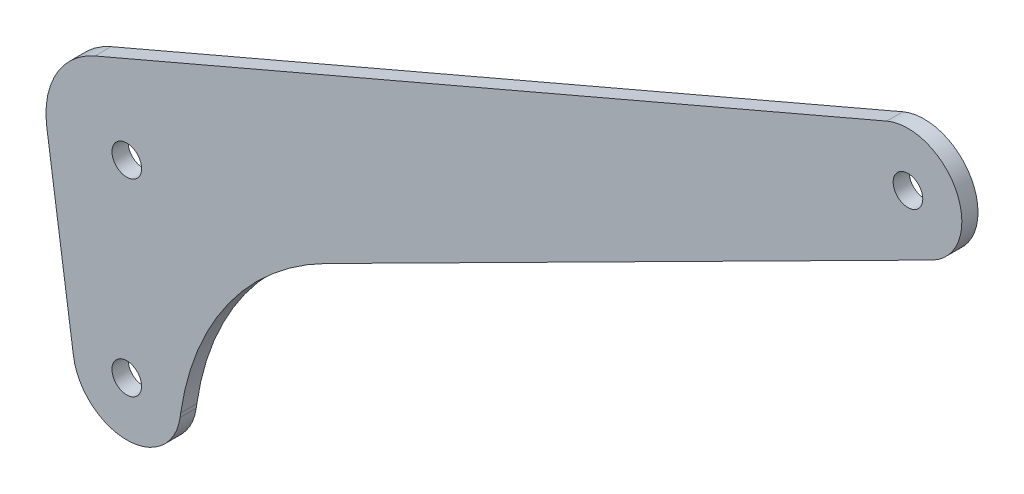
ISO-10303-21;
HEADER;
FILE_DESCRIPTION(('STEP AP214'),'2;1');
FILE_NAME('part.step','',(''),(''),'','','');
FILE_SCHEMA(('AUTOMOTIVE_DESIGN { 1 0 10303 214 1 1 1 1 }'));
ENDSEC;
DATA;
#1=APPLICATION_CONTEXT('core data for automotive mechanical design processes');
#2=APPLICATION_PROTOCOL_DEFINITION('international standard','automotive_design',2000,#1);
#3=PRODUCT_CONTEXT('',#1,'mechanical');
#4=PRODUCT('Part','Part','',(#3));
#5=PRODUCT_RELATED_PRODUCT_CATEGORY('part','',(#4));
#6=PRODUCT_DEFINITION_FORMATION('','',#4);
#7=PRODUCT_DEFINITION_CONTEXT('part definition',#1,'design');
#8=PRODUCT_DEFINITION('design','',#6,#7);
#9=PRODUCT_DEFINITION_SHAPE('','',#8);
#10=(LENGTH_UNIT() NAMED_UNIT(*) SI_UNIT(.MILLI.,.METRE.));
#11=(NAMED_UNIT(*) PLANE_ANGLE_UNIT() SI_UNIT($,.RADIAN.));
#12=(NAMED_UNIT(*) SI_UNIT($,.STERADIAN.) SOLID_ANGLE_UNIT());
#13=UNCERTAINTY_MEASURE_WITH_UNIT(LENGTH_MEASURE(1.E-05),#10,'distance_accuracy_value','');
#14=(GEOMETRIC_REPRESENTATION_CONTEXT(3) GLOBAL_UNCERTAINTY_ASSIGNED_CONTEXT((#13)) GLOBAL_UNIT_ASSIGNED_CONTEXT((#10,
#11,#12)) REPRESENTATION_CONTEXT('',''));
#15=CARTESIAN_POINT('',(0.,0.,0.));
#16=DIRECTION('',(0.,0.,1.));
#17=DIRECTION('',(1.,0.,0.));
#18=AXIS2_PLACEMENT_3D('',#15,#16,#17);
#19=CARTESIAN_POINT('',(0.,35.,3.));
#20=DIRECTION('',(0.,0.,-1.));
#21=DIRECTION('',(-1.,0.,0.));
#22=AXIS2_PLACEMENT_3D('',#19,#20,#21);
#23=CYLINDRICAL_SURFACE('',#22,15.);
#24=CARTESIAN_POINT('',(0.,35.,0.));
#25=DIRECTION('',(0.,0.,1.));
#26=DIRECTION('',(1.,0.,0.));
#27=AXIS2_PLACEMENT_3D('',#24,#25,#26);
#28=CIRCLE('',#27,15.);
#29=CARTESIAN_POINT('',(-5.91134604627073,48.7860794978572,0.));
#30=VERTEX_POINT('',#29);
#31=CARTESIAN_POINT('',(-14.8461497791618,32.8571428571429,0.));
#32=VERTEX_POINT('',#31);
#33=EDGE_CURVE('E133',#30,#32,#28,.T.);
#34=ORIENTED_EDGE('',*,*,#33,.T.);
#35=DIRECTION('',(0.,0.,-1.));
#36=VECTOR('',#35,1.);
#37=CARTESIAN_POINT('',(-14.8461497791618,32.8571428571429,3.));
#38=LINE('',#37,#36);
#39=CARTESIAN_POINT('',(-14.8461497791618,32.8571428571429,3.));
#40=VERTEX_POINT('',#39);
#41=EDGE_CURVE('E11',#40,#32,#38,.T.);
#42=ORIENTED_EDGE('',*,*,#41,.F.);
#43=CARTESIAN_POINT('',(0.,35.,3.));
#44=DIRECTION('',(0.,0.,1.));
#45=DIRECTION('',(1.,0.,0.));
#46=AXIS2_PLACEMENT_3D('',#43,#44,#45);
#47=CIRCLE('',#46,15.);
#48=CARTESIAN_POINT('',(-5.91134604627073,48.7860794978572,3.));
#49=VERTEX_POINT('',#48);
#50=EDGE_CURVE('E91',#49,#40,#47,.T.);
#51=ORIENTED_EDGE('',*,*,#50,.F.);
#52=DIRECTION('',(0.,0.,-1.));
#53=VECTOR('',#52,1.);
#54=CARTESIAN_POINT('',(-5.91134604627073,48.7860794978572,3.));
#55=LINE('',#54,#53);
#56=EDGE_CURVE('E132',#49,#30,#55,.T.);
#57=ORIENTED_EDGE('',*,*,#56,.T.);
#58=EDGE_LOOP('',(#34,#42,#51,#57));
#59=FACE_BOUND('',#58,.T.);
#60=ADVANCED_FACE('F36',(#59),#23,.T.);
#61=CARTESIAN_POINT('',(-9.89743318610787,-1.42857142857143,3.));
#62=DIRECTION('',(-0.989743318610787,-0.142857142857143,0.));
#63=DIRECTION('',(0.142857142857143,-0.989743318610787,0.));
#64=AXIS2_PLACEMENT_3D('',#61,#62,#63);
#65=PLANE('',#64);
#66=DIRECTION('',(-0.142857142857143,0.989743318610787,0.));
#67=VECTOR('',#66,1.);
#68=CARTESIAN_POINT('',(-9.89743318610787,-1.42857142857143,0.));
#69=LINE('',#68,#67);
#70=CARTESIAN_POINT('',(-9.89743318610787,-1.42857142857143,0.));
#71=VERTEX_POINT('',#70);
#72=EDGE_CURVE('E136',#71,#32,#69,.T.);
#73=ORIENTED_EDGE('',*,*,#72,.F.);
#74=DIRECTION('',(0.,0.,-1.));
#75=VECTOR('',#74,1.);
#76=CARTESIAN_POINT('',(-9.89743318610787,-1.42857142857143,3.));
#77=LINE('',#76,#75);
#78=CARTESIAN_POINT('',(-9.89743318610787,-1.42857142857143,3.));
#79=VERTEX_POINT('',#78);
#80=EDGE_CURVE('E44',#79,#71,#77,.T.);
#81=ORIENTED_EDGE('',*,*,#80,.F.);
#82=DIRECTION('',(-0.142857142857143,0.989743318610787,0.));
#83=VECTOR('',#82,1.);
#84=CARTESIAN_POINT('',(-9.89743318610787,-1.42857142857143,3.));
#85=LINE('',#84,#83);
#86=EDGE_CURVE('E173',#79,#40,#85,.T.);
#87=ORIENTED_EDGE('',*,*,#86,.T.);
#88=ORIENTED_EDGE('',*,*,#41,.T.);
#89=EDGE_LOOP('',(#73,#81,#87,#88));
#90=FACE_BOUND('',#89,.T.);
#91=ADVANCED_FACE('F172',(#90),#65,.T.);
#92=CARTESIAN_POINT('',(0.,0.,3.));
#93=DIRECTION('',(0.,0.,-1.));
#94=DIRECTION('',(-1.,0.,0.));
#95=AXIS2_PLACEMENT_3D('',#92,#93,#94);
#96=CYLINDRICAL_SURFACE('',#95,10.);
#97=CARTESIAN_POINT('',(0.,0.,0.));
#98=DIRECTION('',(0.,0.,1.));
#99=DIRECTION('',(1.,0.,0.));
#100=AXIS2_PLACEMENT_3D('',#97,#98,#99);
#101=CIRCLE('',#100,10.);
#102=CARTESIAN_POINT('',(9.89743318610787,-1.42857142857143,0.));
#103=VERTEX_POINT('',#102);
#104=EDGE_CURVE('E140',#71,#103,#101,.T.);
#105=ORIENTED_EDGE('',*,*,#104,.T.);
#106=DIRECTION('',(0.,0.,-1.));
#107=VECTOR('',#106,1.);
#108=CARTESIAN_POINT('',(9.89743318610787,-1.42857142857143,3.));
#109=LINE('',#108,#107);
#110=CARTESIAN_POINT('',(9.89743318610787,-1.42857142857143,3.));
#111=VERTEX_POINT('',#110);
#112=EDGE_CURVE('E157',#111,#103,#109,.T.);
#113=ORIENTED_EDGE('',*,*,#112,.F.);
#114=CARTESIAN_POINT('',(0.,0.,3.));
#115=DIRECTION('',(0.,0.,1.));
#116=DIRECTION('',(1.,0.,0.));
#117=AXIS2_PLACEMENT_3D('',#114,#115,#116);
#118=CIRCLE('',#117,10.);
#119=EDGE_CURVE('E163',#79,#111,#118,.T.);
#120=ORIENTED_EDGE('',*,*,#119,.F.);
#121=ORIENTED_EDGE('',*,*,#80,.T.);
#122=EDGE_LOOP('',(#105,#113,#120,#121));
#123=FACE_BOUND('',#122,.T.);
#124=ADVANCED_FACE('F161',(#123),#96,.T.);
#125=CARTESIAN_POINT('',(9.89743318610787,-1.42857142857143,3.));
#126=DIRECTION('',(0.989743318610787,-0.142857142857143,0.));
#127=DIRECTION('',(0.142857142857143,0.989743318610787,0.));
#128=AXIS2_PLACEMENT_3D('',#125,#126,#127);
#129=PLANE('',#128);
#130=DIRECTION('',(-0.142857142857143,-0.989743318610787,0.));
#131=VECTOR('',#130,1.);
#132=CARTESIAN_POINT('',(9.89743318610787,-1.42857142857143,0.));
#133=LINE('',#132,#131);
#134=CARTESIAN_POINT('',(10.012724365218,-0.629810709038242,0.));
#135=VERTEX_POINT('',#134);
#136=EDGE_CURVE('E143',#135,#103,#133,.T.);
#137=ORIENTED_EDGE('',*,*,#136,.F.);
#138=DIRECTION('',(0.,0.,-1.));
#139=VECTOR('',#138,1.);
#140=CARTESIAN_POINT('',(10.012724365218,-0.629810709038242,3.));
#141=LINE('',#140,#139);
#142=CARTESIAN_POINT('',(10.012724365218,-0.629810709038242,3.));
#143=VERTEX_POINT('',#142);
#144=EDGE_CURVE('E155',#143,#135,#141,.T.);
#145=ORIENTED_EDGE('',*,*,#144,.F.);
#146=DIRECTION('',(-0.142857142857143,-0.989743318610787,0.));
#147=VECTOR('',#146,1.);
#148=CARTESIAN_POINT('',(9.89743318610787,-1.42857142857143,3.));
#149=LINE('',#148,#147);
#150=EDGE_CURVE('E127',#143,#111,#149,.T.);
#151=ORIENTED_EDGE('',*,*,#150,.T.);
#152=ORIENTED_EDGE('',*,*,#112,.T.);
#153=EDGE_LOOP('',(#137,#145,#151,#152));
#154=FACE_BOUND('',#153,.T.);
#155=ADVANCED_FACE('F177',(#154),#129,.T.);
#156=CARTESIAN_POINT('',(59.4998902957574,-7.77266785189538,3.));
#157=DIRECTION('',(0.,0.,-1.));
#158=DIRECTION('',(-1.,0.,0.));
#159=AXIS2_PLACEMENT_3D('',#156,#157,#158);
#160=CYLINDRICAL_SURFACE('',#159,50.);
#161=CARTESIAN_POINT('',(59.4998902957574,-7.77266785189538,0.));
#162=DIRECTION('',(0.,0.,1.));
#163=DIRECTION('',(1.,0.,0.));
#164=AXIS2_PLACEMENT_3D('',#161,#162,#163);
#165=CIRCLE('',#164,50.);
#166=CARTESIAN_POINT('',(36.9631916403654,36.8602484063557,0.));
#167=VERTEX_POINT('',#166);
#168=EDGE_CURVE('E146',#135,#167,#165,.F.);
#169=ORIENTED_EDGE('',*,*,#168,.T.);
#170=DIRECTION('',(0.,0.,-1.));
#171=VECTOR('',#170,1.);
#172=CARTESIAN_POINT('',(36.9631916403654,36.8602484063557,3.));
#173=LINE('',#172,#171);
#174=CARTESIAN_POINT('',(36.9631916403654,36.8602484063557,3.));
#175=VERTEX_POINT('',#174);
#176=EDGE_CURVE('E115',#175,#167,#173,.T.);
#177=ORIENTED_EDGE('',*,*,#176,.F.);
#178=CARTESIAN_POINT('',(59.4998902957574,-7.77266785189538,3.));
#179=DIRECTION('',(0.,0.,1.));
#180=DIRECTION('',(1.,0.,0.));
#181=AXIS2_PLACEMENT_3D('',#178,#179,#180);
#182=CIRCLE('',#181,50.);
#183=EDGE_CURVE('E124',#143,#175,#182,.F.);
#184=ORIENTED_EDGE('',*,*,#183,.F.);
#185=ORIENTED_EDGE('',*,*,#144,.T.);
#186=EDGE_LOOP('',(#169,#177,#184,#185));
#187=FACE_BOUND('',#186,.T.);
#188=ADVANCED_FACE('F236',(#187),#160,.F.);
#189=CARTESIAN_POINT('',(-7.32129057691211,14.4994861145494,3.));
#190=DIRECTION('',(0.45073397310784,-0.892658325165021,0.));
#191=DIRECTION('',(0.892658325165022,0.45073397310784,0.));
#192=AXIS2_PLACEMENT_3D('',#189,#190,#191);
#193=PLANE('',#192);
#194=DIRECTION('',(-0.892658325165022,-0.45073397310784,0.));
#195=VECTOR('',#194,1.);
#196=CARTESIAN_POINT('',(-7.32129057691211,14.4994861145494,0.));
#197=LINE('',#196,#195);
#198=CARTESIAN_POINT('',(149.516585656943,93.6923386268613,0.));
#199=VERTEX_POINT('',#198);
#200=EDGE_CURVE('E114',#199,#167,#197,.T.);
#201=ORIENTED_EDGE('',*,*,#200,.F.);
#202=DIRECTION('',(0.,0.,-1.));
#203=VECTOR('',#202,1.);
#204=CARTESIAN_POINT('',(149.516585656943,93.6923386268613,3.));
#205=LINE('',#204,#203);
#206=CARTESIAN_POINT('',(149.516585656943,93.6923386268613,3.));
#207=VERTEX_POINT('',#206);
#208=EDGE_CURVE('E108',#207,#199,#205,.T.);
#209=ORIENTED_EDGE('',*,*,#208,.F.);
#210=DIRECTION('',(-0.892658325165022,-0.45073397310784,0.));
#211=VECTOR('',#210,1.);
#212=CARTESIAN_POINT('',(-7.32129057691211,14.4994861145494,3.));
#213=LINE('',#212,#211);
#214=EDGE_CURVE('E112',#207,#175,#213,.T.);
#215=ORIENTED_EDGE('',*,*,#214,.T.);
#216=ORIENTED_EDGE('',*,*,#176,.T.);
#217=EDGE_LOOP('',(#201,#209,#215,#216));
#218=FACE_BOUND('',#217,.T.);
#219=ADVANCED_FACE('F110',(#218),#193,.T.);
#220=CARTESIAN_POINT('',(145.009245925864,102.618921878512,3.));
#221=DIRECTION('',(0.,0.,-1.));
#222=DIRECTION('',(-1.,0.,0.));
#223=AXIS2_PLACEMENT_3D('',#220,#221,#222);
#224=CYLINDRICAL_SURFACE('',#223,10.);
#225=CARTESIAN_POINT('',(145.009245925864,102.618921878512,0.));
#226=DIRECTION('',(0.,0.,1.));
#227=DIRECTION('',(1.,0.,0.));
#228=AXIS2_PLACEMENT_3D('',#225,#226,#227);
#229=CIRCLE('',#228,10.);
#230=CARTESIAN_POINT('',(141.068348561684,111.80964154375,0.));
#231=VERTEX_POINT('',#230);
#232=EDGE_CURVE('E79',#199,#231,#229,.T.);
#233=ORIENTED_EDGE('',*,*,#232,.T.);
#234=DIRECTION('',(0.,0.,-1.));
#235=VECTOR('',#234,1.);
#236=CARTESIAN_POINT('',(141.068348561684,111.80964154375,3.));
#237=LINE('',#236,#235);
#238=CARTESIAN_POINT('',(141.068348561684,111.80964154375,3.));
#239=VERTEX_POINT('',#238);
#240=EDGE_CURVE('E116',#239,#231,#237,.T.);
#241=ORIENTED_EDGE('',*,*,#240,.F.);
#242=CARTESIAN_POINT('',(145.009245925864,102.618921878512,3.));
#243=DIRECTION('',(0.,0.,1.));
#244=DIRECTION('',(1.,0.,0.));
#245=AXIS2_PLACEMENT_3D('',#242,#243,#244);
#246=CIRCLE('',#245,10.);
#247=EDGE_CURVE('E118',#207,#239,#246,.T.);
#248=ORIENTED_EDGE('',*,*,#247,.F.);
#249=ORIENTED_EDGE('',*,*,#208,.T.);
#250=EDGE_LOOP('',(#233,#241,#248,#249));
#251=FACE_BOUND('',#250,.T.);
#252=ADVANCED_FACE('F119',(#251),#224,.T.);
#253=CARTESIAN_POINT('',(-18.5882350625513,43.3503442856056,3.));
#254=DIRECTION('',(0.394089736418049,-0.919071966523815,0.));
#255=DIRECTION('',(0.919071966523815,0.394089736418049,0.));
#256=AXIS2_PLACEMENT_3D('',#253,#254,#255);
#257=PLANE('',#256);
#258=DIRECTION('',(-0.919071966523815,-0.394089736418049,0.));
#259=VECTOR('',#258,1.);
#260=CARTESIAN_POINT('',(-18.5882350625513,43.3503442856056,0.));
#261=LINE('',#260,#259);
#262=EDGE_CURVE('E85',#231,#30,#261,.T.);
#263=ORIENTED_EDGE('',*,*,#262,.T.);
#264=ORIENTED_EDGE('',*,*,#56,.F.);
#265=DIRECTION('',(-0.919071966523815,-0.394089736418049,0.));
#266=VECTOR('',#265,1.);
#267=CARTESIAN_POINT('',(-18.5882350625513,43.3503442856056,3.));
#268=LINE('',#267,#266);
#269=EDGE_CURVE('E52',#239,#49,#268,.T.);
#270=ORIENTED_EDGE('',*,*,#269,.F.);
#271=ORIENTED_EDGE('',*,*,#240,.T.);
#272=EDGE_LOOP('',(#263,#264,#270,#271));
#273=FACE_BOUND('',#272,.T.);
#274=ADVANCED_FACE('F205',(#273),#257,.F.);
#275=CARTESIAN_POINT('',(0.,0.,3.));
#276=DIRECTION('',(0.,0.,1.));
#277=DIRECTION('',(1.,0.,0.));
#278=AXIS2_PLACEMENT_3D('',#275,#276,#277);
#279=PLANE('',#278);
#280=CARTESIAN_POINT('',(145.009245925864,102.618921878512,3.));
#281=DIRECTION('',(0.,0.,1.));
#282=DIRECTION('',(1.,0.,0.));
#283=AXIS2_PLACEMENT_3D('',#280,#281,#282);
#284=CIRCLE('',#283,2.74999999999997);
#285=CARTESIAN_POINT('',(147.759245925864,102.618921878512,3.));
#286=VERTEX_POINT('',#285);
#287=EDGE_CURVE('E197',#286,#286,#284,.T.);
#288=ORIENTED_EDGE('',*,*,#287,.F.);
#289=EDGE_LOOP('',(#288));
#290=FACE_BOUND('',#289,.T.);
#291=CARTESIAN_POINT('',(0.,35.,3.));
#292=DIRECTION('',(0.,0.,1.));
#293=DIRECTION('',(1.,0.,0.));
#294=AXIS2_PLACEMENT_3D('',#291,#292,#293);
#295=CIRCLE('',#294,2.74999999999999);
#296=CARTESIAN_POINT('',(2.74999999999999,35.,3.));
#297=VERTEX_POINT('',#296);
#298=EDGE_CURVE('E191',#297,#297,#295,.T.);
#299=ORIENTED_EDGE('',*,*,#298,.F.);
#300=EDGE_LOOP('',(#299));
#301=FACE_BOUND('',#300,.T.);
#302=CARTESIAN_POINT('',(0.,0.,3.));
#303=DIRECTION('',(0.,0.,1.));
#304=DIRECTION('',(1.,0.,0.));
#305=AXIS2_PLACEMENT_3D('',#302,#303,#304);
#306=CIRCLE('',#305,2.74999999999999);
#307=CARTESIAN_POINT('',(2.74999999999999,0.,3.));
#308=VERTEX_POINT('',#307);
#309=EDGE_CURVE('E185',#308,#308,#306,.T.);
#310=ORIENTED_EDGE('',*,*,#309,.F.);
#311=EDGE_LOOP('',(#310));
#312=FACE_BOUND('',#311,.T.);
#313=ORIENTED_EDGE('',*,*,#50,.T.);
#314=ORIENTED_EDGE('',*,*,#86,.F.);
#315=ORIENTED_EDGE('',*,*,#119,.T.);
#316=ORIENTED_EDGE('',*,*,#150,.F.);
#317=ORIENTED_EDGE('',*,*,#183,.T.);
#318=ORIENTED_EDGE('',*,*,#214,.F.);
#319=ORIENTED_EDGE('',*,*,#247,.T.);
#320=ORIENTED_EDGE('',*,*,#269,.T.);
#321=EDGE_LOOP('',(#313,#314,#315,#316,#317,#318,#319,#320));
#322=FACE_BOUND('',#321,.T.);
#323=ADVANCED_FACE('F121',(#290,#301,#312,#322),#279,.T.);
#324=CARTESIAN_POINT('',(0.,0.,0.));
#325=DIRECTION('',(0.,0.,1.));
#326=DIRECTION('',(1.,0.,0.));
#327=AXIS2_PLACEMENT_3D('',#324,#325,#326);
#328=PLANE('',#327);
#329=CARTESIAN_POINT('',(145.009245925864,102.618921878512,0.));
#330=DIRECTION('',(0.,0.,1.));
#331=DIRECTION('',(1.,0.,0.));
#332=AXIS2_PLACEMENT_3D('',#329,#330,#331);
#333=CIRCLE('',#332,2.75);
#334=CARTESIAN_POINT('',(147.759245925864,102.618921878512,0.));
#335=VERTEX_POINT('',#334);
#336=EDGE_CURVE('E194',#335,#335,#333,.T.);
#337=ORIENTED_EDGE('',*,*,#336,.T.);
#338=EDGE_LOOP('',(#337));
#339=FACE_BOUND('',#338,.T.);
#340=CARTESIAN_POINT('',(0.,35.,0.));
#341=DIRECTION('',(0.,0.,1.));
#342=DIRECTION('',(1.,0.,0.));
#343=AXIS2_PLACEMENT_3D('',#340,#341,#342);
#344=CIRCLE('',#343,2.75);
#345=CARTESIAN_POINT('',(2.75,35.,0.));
#346=VERTEX_POINT('',#345);
#347=EDGE_CURVE('E188',#346,#346,#344,.T.);
#348=ORIENTED_EDGE('',*,*,#347,.T.);
#349=EDGE_LOOP('',(#348));
#350=FACE_BOUND('',#349,.T.);
#351=CARTESIAN_POINT('',(0.,0.,0.));
#352=DIRECTION('',(0.,0.,1.));
#353=DIRECTION('',(1.,0.,0.));
#354=AXIS2_PLACEMENT_3D('',#351,#352,#353);
#355=CIRCLE('',#354,2.75);
#356=CARTESIAN_POINT('',(2.75,0.,0.));
#357=VERTEX_POINT('',#356);
#358=EDGE_CURVE('E137',#357,#357,#355,.T.);
#359=ORIENTED_EDGE('',*,*,#358,.T.);
#360=EDGE_LOOP('',(#359));
#361=FACE_BOUND('',#360,.T.);
#362=ORIENTED_EDGE('',*,*,#33,.F.);
#363=ORIENTED_EDGE('',*,*,#262,.F.);
#364=ORIENTED_EDGE('',*,*,#232,.F.);
#365=ORIENTED_EDGE('',*,*,#200,.T.);
#366=ORIENTED_EDGE('',*,*,#168,.F.);
#367=ORIENTED_EDGE('',*,*,#136,.T.);
#368=ORIENTED_EDGE('',*,*,#104,.F.);
#369=ORIENTED_EDGE('',*,*,#72,.T.);
#370=EDGE_LOOP('',(#362,#363,#364,#365,#366,#367,#368,#369));
#371=FACE_BOUND('',#370,.T.);
#372=ADVANCED_FACE('F169',(#339,#350,#361,#371),#328,.F.);
#373=CARTESIAN_POINT('',(0.,0.,3.));
#374=DIRECTION('',(0.,0.,1.));
#375=DIRECTION('',(1.,0.,0.));
#376=AXIS2_PLACEMENT_3D('',#373,#374,#375);
#377=CYLINDRICAL_SURFACE('',#376,2.74999999999999);
#378=ORIENTED_EDGE('',*,*,#358,.F.);
#379=EDGE_LOOP('',(#378));
#380=FACE_BOUND('',#379,.T.);
#381=ORIENTED_EDGE('',*,*,#309,.T.);
#382=EDGE_LOOP('',(#381));
#383=FACE_BOUND('',#382,.T.);
#384=ADVANCED_FACE('F211',(#380,#383),#377,.F.);
#385=CARTESIAN_POINT('',(0.,35.,3.));
#386=DIRECTION('',(0.,0.,1.));
#387=DIRECTION('',(1.,0.,0.));
#388=AXIS2_PLACEMENT_3D('',#385,#386,#387);
#389=CYLINDRICAL_SURFACE('',#388,2.74999999999999);
#390=ORIENTED_EDGE('',*,*,#347,.F.);
#391=EDGE_LOOP('',(#390));
#392=FACE_BOUND('',#391,.T.);
#393=ORIENTED_EDGE('',*,*,#298,.T.);
#394=EDGE_LOOP('',(#393));
#395=FACE_BOUND('',#394,.T.);
#396=ADVANCED_FACE('F213',(#392,#395),#389,.F.);
#397=CARTESIAN_POINT('',(145.009245925864,102.618921878512,3.));
#398=DIRECTION('',(0.,0.,1.));
#399=DIRECTION('',(1.,0.,0.));
#400=AXIS2_PLACEMENT_3D('',#397,#398,#399);
#401=CYLINDRICAL_SURFACE('',#400,2.74999999999999);
#402=ORIENTED_EDGE('',*,*,#336,.F.);
#403=EDGE_LOOP('',(#402));
#404=FACE_BOUND('',#403,.T.);
#405=ORIENTED_EDGE('',*,*,#287,.T.);
#406=EDGE_LOOP('',(#405));
#407=FACE_BOUND('',#406,.T.);
#408=ADVANCED_FACE('F201',(#404,#407),#401,.F.);
#409=CLOSED_SHELL('',(#60,#91,#124,#155,#188,#219,#252,#274,#323,#372,#384,#396,#408));
#410=MANIFOLD_SOLID_BREP('B2',#409);
#411=ADVANCED_BREP_SHAPE_REPRESENTATION('',(#18,#410),#14);
#412=SHAPE_DEFINITION_REPRESENTATION(#9,#411);
ENDSEC;
END-ISO-10303-21;
